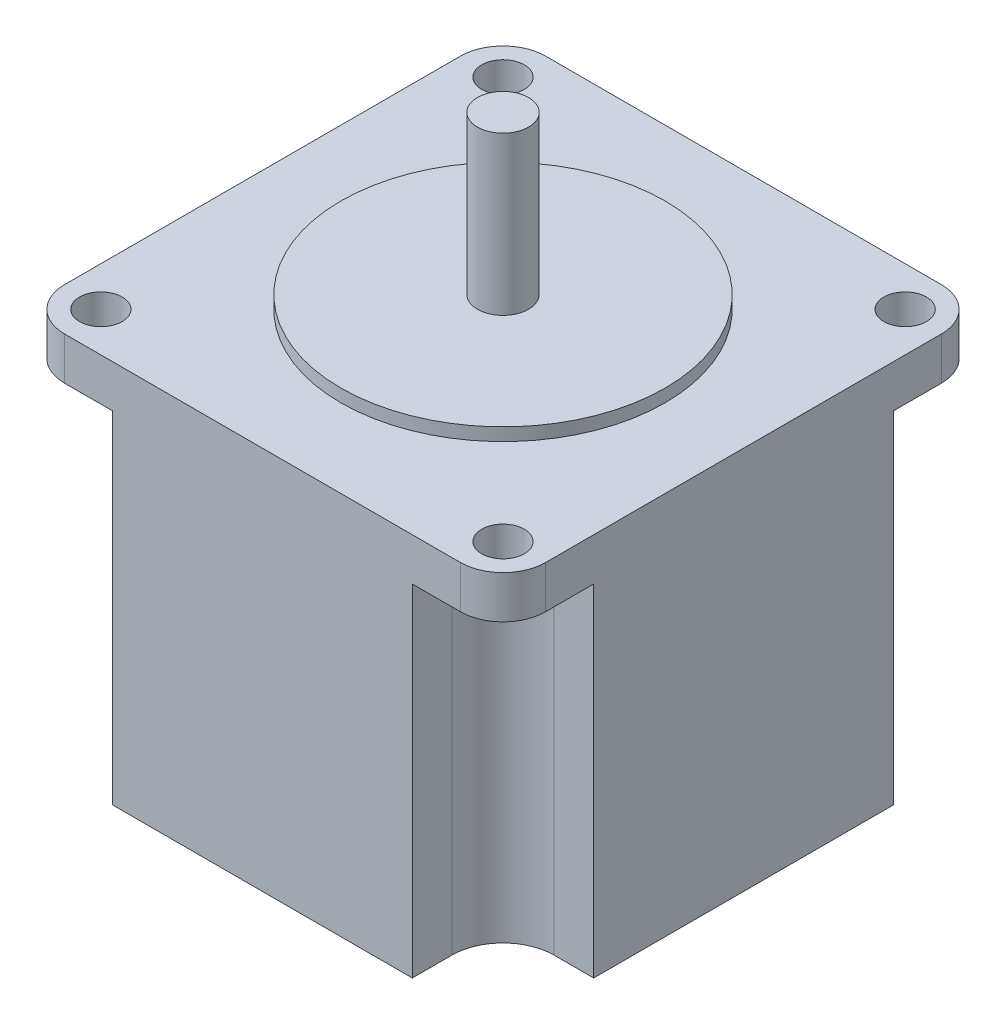
ISO-10303-21;
HEADER;
FILE_DESCRIPTION(('STEP AP214'),'2;1');
FILE_NAME('part.step','',(''),(''),'','','');
FILE_SCHEMA(('AUTOMOTIVE_DESIGN { 1 0 10303 214 1 1 1 1 }'));
ENDSEC;
DATA;
#1=APPLICATION_CONTEXT('core data for automotive mechanical design processes');
#2=APPLICATION_PROTOCOL_DEFINITION('international standard','automotive_design',2000,#1);
#3=PRODUCT_CONTEXT('',#1,'mechanical');
#4=PRODUCT('Part','Part','',(#3));
#5=PRODUCT_RELATED_PRODUCT_CATEGORY('part','',(#4));
#6=PRODUCT_DEFINITION_FORMATION('','',#4);
#7=PRODUCT_DEFINITION_CONTEXT('part definition',#1,'design');
#8=PRODUCT_DEFINITION('design','',#6,#7);
#9=PRODUCT_DEFINITION_SHAPE('','',#8);
#10=(LENGTH_UNIT() NAMED_UNIT(*) SI_UNIT(.MILLI.,.METRE.));
#11=(NAMED_UNIT(*) PLANE_ANGLE_UNIT() SI_UNIT($,.RADIAN.));
#12=(NAMED_UNIT(*) SI_UNIT($,.STERADIAN.) SOLID_ANGLE_UNIT());
#13=UNCERTAINTY_MEASURE_WITH_UNIT(LENGTH_MEASURE(1.E-05),#10,'distance_accuracy_value','');
#14=(GEOMETRIC_REPRESENTATION_CONTEXT(3) GLOBAL_UNCERTAINTY_ASSIGNED_CONTEXT((#13)) GLOBAL_UNIT_ASSIGNED_CONTEXT((#10,
#11,#12)) REPRESENTATION_CONTEXT('',''));
#15=CARTESIAN_POINT('',(0.,0.,0.));
#16=DIRECTION('',(0.,0.,1.));
#17=DIRECTION('',(1.,0.,0.));
#18=AXIS2_PLACEMENT_3D('',#15,#16,#17);
#19=CARTESIAN_POINT('',(-23.2,0.,23.2));
#20=DIRECTION('',(0.,1.,0.));
#21=DIRECTION('',(0.,0.,1.));
#22=AXIS2_PLACEMENT_3D('',#19,#20,#21);
#23=PLANE('',#22);
#24=DIRECTION('',(-1.,0.,0.));
#25=VECTOR('',#24,1.);
#26=CARTESIAN_POINT('',(-28.2,0.,17.57));
#27=LINE('',#26,#25);
#28=CARTESIAN_POINT('',(-23.57,0.,17.57));
#29=VERTEX_POINT('',#28);
#30=CARTESIAN_POINT('',(-28.2,0.,17.57));
#31=VERTEX_POINT('',#30);
#32=EDGE_CURVE('E324',#29,#31,#27,.T.);
#33=ORIENTED_EDGE('',*,*,#32,.T.);
#34=DIRECTION('',(0.,0.,1.));
#35=VECTOR('',#34,1.);
#36=CARTESIAN_POINT('',(-28.2,0.,23.2));
#37=LINE('',#36,#35);
#38=CARTESIAN_POINT('',(-28.2,0.,-17.57));
#39=VERTEX_POINT('',#38);
#40=EDGE_CURVE('E413',#39,#31,#37,.T.);
#41=ORIENTED_EDGE('',*,*,#40,.F.);
#42=DIRECTION('',(1.,0.,0.));
#43=VECTOR('',#42,1.);
#44=CARTESIAN_POINT('',(-28.2,0.,-17.57));
#45=LINE('',#44,#43);
#46=CARTESIAN_POINT('',(-23.57,0.,-17.57));
#47=VERTEX_POINT('',#46);
#48=EDGE_CURVE('E260',#39,#47,#45,.T.);
#49=ORIENTED_EDGE('',*,*,#48,.T.);
#50=CARTESIAN_POINT('',(-23.57,0.,-23.57));
#51=DIRECTION('',(0.,1.,0.));
#52=DIRECTION('',(0.,0.,1.));
#53=AXIS2_PLACEMENT_3D('',#50,#51,#52);
#54=CIRCLE('',#53,6.);
#55=CARTESIAN_POINT('',(-17.57,0.,-23.57));
#56=VERTEX_POINT('',#55);
#57=EDGE_CURVE('E266',#47,#56,#54,.T.);
#58=ORIENTED_EDGE('',*,*,#57,.T.);
#59=DIRECTION('',(0.,0.,-1.));
#60=VECTOR('',#59,1.);
#61=CARTESIAN_POINT('',(-17.57,0.,-23.57));
#62=LINE('',#61,#60);
#63=CARTESIAN_POINT('',(-17.57,0.,-28.2));
#64=VERTEX_POINT('',#63);
#65=EDGE_CURVE('E373',#56,#64,#62,.T.);
#66=ORIENTED_EDGE('',*,*,#65,.T.);
#67=DIRECTION('',(-1.,0.,0.));
#68=VECTOR('',#67,1.);
#69=CARTESIAN_POINT('',(-23.2,0.,-28.2));
#70=LINE('',#69,#68);
#71=CARTESIAN_POINT('',(17.57,0.,-28.2));
#72=VERTEX_POINT('',#71);
#73=EDGE_CURVE('E441',#72,#64,#70,.T.);
#74=ORIENTED_EDGE('',*,*,#73,.F.);
#75=DIRECTION('',(0.,0.,1.));
#76=VECTOR('',#75,1.);
#77=CARTESIAN_POINT('',(17.57,0.,-23.57));
#78=LINE('',#77,#76);
#79=CARTESIAN_POINT('',(17.57,0.,-23.57));
#80=VERTEX_POINT('',#79);
#81=EDGE_CURVE('E366',#72,#80,#78,.T.);
#82=ORIENTED_EDGE('',*,*,#81,.T.);
#83=CARTESIAN_POINT('',(23.57,0.,-23.57));
#84=DIRECTION('',(0.,1.,0.));
#85=DIRECTION('',(0.,0.,-1.));
#86=AXIS2_PLACEMENT_3D('',#83,#84,#85);
#87=CIRCLE('',#86,5.99999999999998);
#88=CARTESIAN_POINT('',(23.57,0.,-17.57));
#89=VERTEX_POINT('',#88);
#90=EDGE_CURVE('E361',#80,#89,#87,.T.);
#91=ORIENTED_EDGE('',*,*,#90,.T.);
#92=DIRECTION('',(1.,0.,0.));
#93=VECTOR('',#92,1.);
#94=CARTESIAN_POINT('',(28.2,0.,-17.57));
#95=LINE('',#94,#93);
#96=CARTESIAN_POINT('',(28.2,0.,-17.57));
#97=VERTEX_POINT('',#96);
#98=EDGE_CURVE('E356',#89,#97,#95,.T.);
#99=ORIENTED_EDGE('',*,*,#98,.T.);
#100=DIRECTION('',(0.,0.,-1.));
#101=VECTOR('',#100,1.);
#102=CARTESIAN_POINT('',(28.2,0.,23.2));
#103=LINE('',#102,#101);
#104=CARTESIAN_POINT('',(28.2,0.,17.57));
#105=VERTEX_POINT('',#104);
#106=EDGE_CURVE('E438',#105,#97,#103,.T.);
#107=ORIENTED_EDGE('',*,*,#106,.F.);
#108=DIRECTION('',(-1.,0.,0.));
#109=VECTOR('',#108,1.);
#110=CARTESIAN_POINT('',(28.2,0.,17.57));
#111=LINE('',#110,#109);
#112=CARTESIAN_POINT('',(23.57,0.,17.57));
#113=VERTEX_POINT('',#112);
#114=EDGE_CURVE('E350',#105,#113,#111,.T.);
#115=ORIENTED_EDGE('',*,*,#114,.T.);
#116=CARTESIAN_POINT('',(23.57,0.,23.57));
#117=DIRECTION('',(0.,1.,0.));
#118=DIRECTION('',(0.,0.,1.));
#119=AXIS2_PLACEMENT_3D('',#116,#117,#118);
#120=CIRCLE('',#119,6.);
#121=CARTESIAN_POINT('',(17.57,0.,23.57));
#122=VERTEX_POINT('',#121);
#123=EDGE_CURVE('E79',#113,#122,#120,.T.);
#124=ORIENTED_EDGE('',*,*,#123,.T.);
#125=DIRECTION('',(0.,0.,1.));
#126=VECTOR('',#125,1.);
#127=CARTESIAN_POINT('',(17.57,0.,23.57));
#128=LINE('',#127,#126);
#129=CARTESIAN_POINT('',(17.57,0.,28.2));
#130=VERTEX_POINT('',#129);
#131=EDGE_CURVE('E342',#122,#130,#128,.T.);
#132=ORIENTED_EDGE('',*,*,#131,.T.);
#133=DIRECTION('',(1.,0.,0.));
#134=VECTOR('',#133,1.);
#135=CARTESIAN_POINT('',(-23.2,0.,28.2));
#136=LINE('',#135,#134);
#137=CARTESIAN_POINT('',(-17.57,0.,28.2));
#138=VERTEX_POINT('',#137);
#139=EDGE_CURVE('E434',#138,#130,#136,.T.);
#140=ORIENTED_EDGE('',*,*,#139,.F.);
#141=DIRECTION('',(0.,0.,-1.));
#142=VECTOR('',#141,1.);
#143=CARTESIAN_POINT('',(-17.57,0.,23.57));
#144=LINE('',#143,#142);
#145=CARTESIAN_POINT('',(-17.57,0.,23.57));
#146=VERTEX_POINT('',#145);
#147=EDGE_CURVE('E335',#138,#146,#144,.T.);
#148=ORIENTED_EDGE('',*,*,#147,.T.);
#149=CARTESIAN_POINT('',(-23.57,0.,23.57));
#150=DIRECTION('',(0.,1.,0.));
#151=DIRECTION('',(0.,0.,-1.));
#152=AXIS2_PLACEMENT_3D('',#149,#150,#151);
#153=CIRCLE('',#152,6.);
#154=EDGE_CURVE('E68',#146,#29,#153,.T.);
#155=ORIENTED_EDGE('',*,*,#154,.T.);
#156=EDGE_LOOP('',(#33,#41,#49,#58,#66,#74,#82,#91,#99,#107,#115,#124,#132,#140,#148,#155));
#157=FACE_BOUND('',#156,.T.);
#158=ADVANCED_FACE('F48',(#157),#23,.F.);
#159=CARTESIAN_POINT('',(-23.2,45.,23.2));
#160=DIRECTION('',(0.,-1.,0.));
#161=DIRECTION('',(0.,0.,-1.));
#162=AXIS2_PLACEMENT_3D('',#159,#160,#161);
#163=CYLINDRICAL_SURFACE('',#162,5.);
#164=DIRECTION('',(0.,-1.,0.));
#165=VECTOR('',#164,1.);
#166=CARTESIAN_POINT('',(-28.2,45.,23.2));
#167=LINE('',#166,#165);
#168=CARTESIAN_POINT('',(-28.2,45.,23.2));
#169=VERTEX_POINT('',#168);
#170=CARTESIAN_POINT('',(-28.2,40.,23.2));
#171=VERTEX_POINT('',#170);
#172=EDGE_CURVE('E433',#169,#171,#167,.T.);
#173=ORIENTED_EDGE('',*,*,#172,.T.);
#174=CARTESIAN_POINT('',(-23.2,40.,23.2));
#175=DIRECTION('',(0.,1.,0.));
#176=DIRECTION('',(0.,0.,1.));
#177=AXIS2_PLACEMENT_3D('',#174,#175,#176);
#178=CIRCLE('',#177,5.);
#179=CARTESIAN_POINT('',(-23.2,40.,28.2));
#180=VERTEX_POINT('',#179);
#181=EDGE_CURVE('E377',#171,#180,#178,.T.);
#182=ORIENTED_EDGE('',*,*,#181,.T.);
#183=DIRECTION('',(0.,-1.,0.));
#184=VECTOR('',#183,1.);
#185=CARTESIAN_POINT('',(-23.2,45.,28.2));
#186=LINE('',#185,#184);
#187=CARTESIAN_POINT('',(-23.2,45.,28.2));
#188=VERTEX_POINT('',#187);
#189=EDGE_CURVE('E288',#188,#180,#186,.T.);
#190=ORIENTED_EDGE('',*,*,#189,.F.);
#191=CARTESIAN_POINT('',(-23.2,45.,23.2));
#192=DIRECTION('',(0.,1.,0.));
#193=DIRECTION('',(0.,0.,1.));
#194=AXIS2_PLACEMENT_3D('',#191,#192,#193);
#195=CIRCLE('',#194,5.);
#196=EDGE_CURVE('E408',#169,#188,#195,.T.);
#197=ORIENTED_EDGE('',*,*,#196,.F.);
#198=EDGE_LOOP('',(#173,#182,#190,#197));
#199=FACE_BOUND('',#198,.T.);
#200=ADVANCED_FACE('F50',(#199),#163,.T.);
#201=CARTESIAN_POINT('',(-23.2,45.,28.2));
#202=DIRECTION('',(0.,0.,-1.));
#203=DIRECTION('',(-1.,0.,0.));
#204=AXIS2_PLACEMENT_3D('',#201,#202,#203);
#205=PLANE('',#204);
#206=ORIENTED_EDGE('',*,*,#189,.T.);
#207=DIRECTION('',(1.,0.,0.));
#208=VECTOR('',#207,1.);
#209=CARTESIAN_POINT('',(-23.2,40.,28.2));
#210=LINE('',#209,#208);
#211=CARTESIAN_POINT('',(-17.57,40.,28.2));
#212=VERTEX_POINT('',#211);
#213=EDGE_CURVE('E381',#180,#212,#210,.T.);
#214=ORIENTED_EDGE('',*,*,#213,.T.);
#215=DIRECTION('',(0.,-1.,0.));
#216=VECTOR('',#215,1.);
#217=CARTESIAN_POINT('',(-17.57,127.803145097442,28.2));
#218=LINE('',#217,#216);
#219=EDGE_CURVE('E331',#212,#138,#218,.T.);
#220=ORIENTED_EDGE('',*,*,#219,.T.);
#221=ORIENTED_EDGE('',*,*,#139,.T.);
#222=DIRECTION('',(0.,-1.,0.));
#223=VECTOR('',#222,1.);
#224=CARTESIAN_POINT('',(17.57,127.803145097442,28.2));
#225=LINE('',#224,#223);
#226=CARTESIAN_POINT('',(17.57,40.,28.2));
#227=VERTEX_POINT('',#226);
#228=EDGE_CURVE('E336',#227,#130,#225,.T.);
#229=ORIENTED_EDGE('',*,*,#228,.F.);
#230=CARTESIAN_POINT('',(23.2,40.,28.2));
#231=VERTEX_POINT('',#230);
#232=EDGE_CURVE('E387',#227,#231,#210,.T.);
#233=ORIENTED_EDGE('',*,*,#232,.T.);
#234=DIRECTION('',(0.,-1.,0.));
#235=VECTOR('',#234,1.);
#236=CARTESIAN_POINT('',(23.2,45.,28.2));
#237=LINE('',#236,#235);
#238=CARTESIAN_POINT('',(23.2,45.,28.2));
#239=VERTEX_POINT('',#238);
#240=EDGE_CURVE('E466',#239,#231,#237,.T.);
#241=ORIENTED_EDGE('',*,*,#240,.F.);
#242=DIRECTION('',(1.,0.,0.));
#243=VECTOR('',#242,1.);
#244=CARTESIAN_POINT('',(-23.2,45.,28.2));
#245=LINE('',#244,#243);
#246=EDGE_CURVE('E412',#188,#239,#245,.T.);
#247=ORIENTED_EDGE('',*,*,#246,.F.);
#248=EDGE_LOOP('',(#206,#214,#220,#221,#229,#233,#241,#247));
#249=FACE_BOUND('',#248,.T.);
#250=ADVANCED_FACE('F479',(#249),#205,.F.);
#251=CARTESIAN_POINT('',(23.2,45.,23.2));
#252=DIRECTION('',(0.,-1.,0.));
#253=DIRECTION('',(0.,0.,-1.));
#254=AXIS2_PLACEMENT_3D('',#251,#252,#253);
#255=CYLINDRICAL_SURFACE('',#254,5.);
#256=ORIENTED_EDGE('',*,*,#240,.T.);
#257=CARTESIAN_POINT('',(23.2,40.,23.2));
#258=DIRECTION('',(0.,1.,0.));
#259=DIRECTION('',(0.,0.,1.));
#260=AXIS2_PLACEMENT_3D('',#257,#258,#259);
#261=CIRCLE('',#260,5.);
#262=CARTESIAN_POINT('',(28.2,40.,23.2));
#263=VERTEX_POINT('',#262);
#264=EDGE_CURVE('E404',#231,#263,#261,.T.);
#265=ORIENTED_EDGE('',*,*,#264,.T.);
#266=DIRECTION('',(0.,-1.,0.));
#267=VECTOR('',#266,1.);
#268=CARTESIAN_POINT('',(28.2,45.,23.2));
#269=LINE('',#268,#267);
#270=CARTESIAN_POINT('',(28.2,45.,23.2));
#271=VERTEX_POINT('',#270);
#272=EDGE_CURVE('E463',#271,#263,#269,.T.);
#273=ORIENTED_EDGE('',*,*,#272,.F.);
#274=CARTESIAN_POINT('',(23.2,45.,23.2));
#275=DIRECTION('',(0.,1.,0.));
#276=DIRECTION('',(0.,0.,-1.));
#277=AXIS2_PLACEMENT_3D('',#274,#275,#276);
#278=CIRCLE('',#277,5.);
#279=EDGE_CURVE('E416',#239,#271,#278,.T.);
#280=ORIENTED_EDGE('',*,*,#279,.F.);
#281=EDGE_LOOP('',(#256,#265,#273,#280));
#282=FACE_BOUND('',#281,.T.);
#283=ADVANCED_FACE('F627',(#282),#255,.T.);
#284=CARTESIAN_POINT('',(28.2,45.,23.2));
#285=DIRECTION('',(-1.,0.,0.));
#286=DIRECTION('',(0.,0.,1.));
#287=AXIS2_PLACEMENT_3D('',#284,#285,#286);
#288=PLANE('',#287);
#289=ORIENTED_EDGE('',*,*,#272,.T.);
#290=DIRECTION('',(0.,0.,-1.));
#291=VECTOR('',#290,1.);
#292=CARTESIAN_POINT('',(28.2,40.,23.2));
#293=LINE('',#292,#291);
#294=CARTESIAN_POINT('',(28.2,40.,17.57));
#295=VERTEX_POINT('',#294);
#296=EDGE_CURVE('E403',#263,#295,#293,.T.);
#297=ORIENTED_EDGE('',*,*,#296,.T.);
#298=DIRECTION('',(0.,-1.,0.));
#299=VECTOR('',#298,1.);
#300=CARTESIAN_POINT('',(28.2,127.803145097442,17.57));
#301=LINE('',#300,#299);
#302=EDGE_CURVE('E346',#295,#105,#301,.T.);
#303=ORIENTED_EDGE('',*,*,#302,.T.);
#304=ORIENTED_EDGE('',*,*,#106,.T.);
#305=DIRECTION('',(0.,-1.,0.));
#306=VECTOR('',#305,1.);
#307=CARTESIAN_POINT('',(28.2,127.803145097442,-17.57));
#308=LINE('',#307,#306);
#309=CARTESIAN_POINT('',(28.2,40.,-17.57));
#310=VERTEX_POINT('',#309);
#311=EDGE_CURVE('E351',#310,#97,#308,.T.);
#312=ORIENTED_EDGE('',*,*,#311,.F.);
#313=CARTESIAN_POINT('',(28.2,40.,-23.2));
#314=VERTEX_POINT('',#313);
#315=EDGE_CURVE('E399',#310,#314,#293,.T.);
#316=ORIENTED_EDGE('',*,*,#315,.T.);
#317=DIRECTION('',(0.,-1.,0.));
#318=VECTOR('',#317,1.);
#319=CARTESIAN_POINT('',(28.2,45.,-23.2));
#320=LINE('',#319,#318);
#321=CARTESIAN_POINT('',(28.2,45.,-23.2));
#322=VERTEX_POINT('',#321);
#323=EDGE_CURVE('E459',#322,#314,#320,.T.);
#324=ORIENTED_EDGE('',*,*,#323,.F.);
#325=DIRECTION('',(0.,0.,-1.));
#326=VECTOR('',#325,1.);
#327=CARTESIAN_POINT('',(28.2,45.,23.2));
#328=LINE('',#327,#326);
#329=EDGE_CURVE('E419',#271,#322,#328,.T.);
#330=ORIENTED_EDGE('',*,*,#329,.F.);
#331=EDGE_LOOP('',(#289,#297,#303,#304,#312,#316,#324,#330));
#332=FACE_BOUND('',#331,.T.);
#333=ADVANCED_FACE('F575',(#332),#288,.F.);
#334=CARTESIAN_POINT('',(23.2,45.,-23.2));
#335=DIRECTION('',(0.,-1.,0.));
#336=DIRECTION('',(0.,0.,-1.));
#337=AXIS2_PLACEMENT_3D('',#334,#335,#336);
#338=CYLINDRICAL_SURFACE('',#337,5.);
#339=ORIENTED_EDGE('',*,*,#323,.T.);
#340=CARTESIAN_POINT('',(23.2,40.,-23.2));
#341=DIRECTION('',(0.,1.,0.));
#342=DIRECTION('',(0.,0.,1.));
#343=AXIS2_PLACEMENT_3D('',#340,#341,#342);
#344=CIRCLE('',#343,5.);
#345=CARTESIAN_POINT('',(23.2,40.,-28.2));
#346=VERTEX_POINT('',#345);
#347=EDGE_CURVE('E395',#314,#346,#344,.T.);
#348=ORIENTED_EDGE('',*,*,#347,.T.);
#349=DIRECTION('',(0.,-1.,0.));
#350=VECTOR('',#349,1.);
#351=CARTESIAN_POINT('',(23.2,45.,-28.2));
#352=LINE('',#351,#350);
#353=CARTESIAN_POINT('',(23.2,45.,-28.2));
#354=VERTEX_POINT('',#353);
#355=EDGE_CURVE('E455',#354,#346,#352,.T.);
#356=ORIENTED_EDGE('',*,*,#355,.F.);
#357=CARTESIAN_POINT('',(23.2,45.,-23.2));
#358=DIRECTION('',(0.,1.,0.));
#359=DIRECTION('',(0.,0.,-1.));
#360=AXIS2_PLACEMENT_3D('',#357,#358,#359);
#361=CIRCLE('',#360,5.);
#362=EDGE_CURVE('E422',#322,#354,#361,.T.);
#363=ORIENTED_EDGE('',*,*,#362,.F.);
#364=EDGE_LOOP('',(#339,#348,#356,#363));
#365=FACE_BOUND('',#364,.T.);
#366=ADVANCED_FACE('F621',(#365),#338,.T.);
#367=CARTESIAN_POINT('',(-23.2,45.,-28.2));
#368=DIRECTION('',(0.,0.,1.));
#369=DIRECTION('',(1.,0.,0.));
#370=AXIS2_PLACEMENT_3D('',#367,#368,#369);
#371=PLANE('',#370);
#372=ORIENTED_EDGE('',*,*,#355,.T.);
#373=DIRECTION('',(-1.,0.,0.));
#374=VECTOR('',#373,1.);
#375=CARTESIAN_POINT('',(-23.2,40.,-28.2));
#376=LINE('',#375,#374);
#377=CARTESIAN_POINT('',(17.57,40.,-28.2));
#378=VERTEX_POINT('',#377);
#379=EDGE_CURVE('E394',#346,#378,#376,.T.);
#380=ORIENTED_EDGE('',*,*,#379,.T.);
#381=DIRECTION('',(0.,-1.,0.));
#382=VECTOR('',#381,1.);
#383=CARTESIAN_POINT('',(17.57,127.803145097442,-28.2));
#384=LINE('',#383,#382);
#385=EDGE_CURVE('E362',#378,#72,#384,.T.);
#386=ORIENTED_EDGE('',*,*,#385,.T.);
#387=ORIENTED_EDGE('',*,*,#73,.T.);
#388=DIRECTION('',(0.,-1.,0.));
#389=VECTOR('',#388,1.);
#390=CARTESIAN_POINT('',(-17.57,127.803145097442,-28.2));
#391=LINE('',#390,#389);
#392=CARTESIAN_POINT('',(-17.57,40.,-28.2));
#393=VERTEX_POINT('',#392);
#394=EDGE_CURVE('E367',#393,#64,#391,.T.);
#395=ORIENTED_EDGE('',*,*,#394,.F.);
#396=CARTESIAN_POINT('',(-23.2,40.,-28.2));
#397=VERTEX_POINT('',#396);
#398=EDGE_CURVE('E390',#393,#397,#376,.T.);
#399=ORIENTED_EDGE('',*,*,#398,.T.);
#400=DIRECTION('',(0.,-1.,0.));
#401=VECTOR('',#400,1.);
#402=CARTESIAN_POINT('',(-23.2,45.,-28.2));
#403=LINE('',#402,#401);
#404=CARTESIAN_POINT('',(-23.2,45.,-28.2));
#405=VERTEX_POINT('',#404);
#406=EDGE_CURVE('E451',#405,#397,#403,.T.);
#407=ORIENTED_EDGE('',*,*,#406,.F.);
#408=DIRECTION('',(-1.,0.,0.));
#409=VECTOR('',#408,1.);
#410=CARTESIAN_POINT('',(-23.2,45.,-28.2));
#411=LINE('',#410,#409);
#412=EDGE_CURVE('E425',#354,#405,#411,.T.);
#413=ORIENTED_EDGE('',*,*,#412,.F.);
#414=EDGE_LOOP('',(#372,#380,#386,#387,#395,#399,#407,#413));
#415=FACE_BOUND('',#414,.T.);
#416=ADVANCED_FACE('F560',(#415),#371,.F.);
#417=CARTESIAN_POINT('',(-23.2,45.,-23.2));
#418=DIRECTION('',(0.,-1.,0.));
#419=DIRECTION('',(0.,0.,-1.));
#420=AXIS2_PLACEMENT_3D('',#417,#418,#419);
#421=CYLINDRICAL_SURFACE('',#420,5.);
#422=ORIENTED_EDGE('',*,*,#406,.T.);
#423=CARTESIAN_POINT('',(-23.2,40.,-23.2));
#424=DIRECTION('',(0.,1.,0.));
#425=DIRECTION('',(0.,0.,1.));
#426=AXIS2_PLACEMENT_3D('',#423,#424,#425);
#427=CIRCLE('',#426,5.);
#428=CARTESIAN_POINT('',(-28.2,40.,-23.2));
#429=VERTEX_POINT('',#428);
#430=EDGE_CURVE('E386',#397,#429,#427,.T.);
#431=ORIENTED_EDGE('',*,*,#430,.T.);
#432=DIRECTION('',(0.,-1.,0.));
#433=VECTOR('',#432,1.);
#434=CARTESIAN_POINT('',(-28.2,45.,-23.2));
#435=LINE('',#434,#433);
#436=CARTESIAN_POINT('',(-28.2,45.,-23.2));
#437=VERTEX_POINT('',#436);
#438=EDGE_CURVE('E281',#437,#429,#435,.T.);
#439=ORIENTED_EDGE('',*,*,#438,.F.);
#440=CARTESIAN_POINT('',(-23.2,45.,-23.2));
#441=DIRECTION('',(0.,1.,0.));
#442=DIRECTION('',(0.,0.,-1.));
#443=AXIS2_PLACEMENT_3D('',#440,#441,#442);
#444=CIRCLE('',#443,5.);
#445=EDGE_CURVE('E428',#405,#437,#444,.T.);
#446=ORIENTED_EDGE('',*,*,#445,.F.);
#447=EDGE_LOOP('',(#422,#431,#439,#446));
#448=FACE_BOUND('',#447,.T.);
#449=ADVANCED_FACE('F615',(#448),#421,.T.);
#450=CARTESIAN_POINT('',(-28.2,45.,23.2));
#451=DIRECTION('',(1.,0.,0.));
#452=DIRECTION('',(0.,0.,-1.));
#453=AXIS2_PLACEMENT_3D('',#450,#451,#452);
#454=PLANE('',#453);
#455=ORIENTED_EDGE('',*,*,#438,.T.);
#456=DIRECTION('',(0.,0.,1.));
#457=VECTOR('',#456,1.);
#458=CARTESIAN_POINT('',(-28.2,40.,23.2));
#459=LINE('',#458,#457);
#460=CARTESIAN_POINT('',(-28.2,40.,-17.57));
#461=VERTEX_POINT('',#460);
#462=EDGE_CURVE('E58',#429,#461,#459,.T.);
#463=ORIENTED_EDGE('',*,*,#462,.T.);
#464=DIRECTION('',(0.,-1.,0.));
#465=VECTOR('',#464,1.);
#466=CARTESIAN_POINT('',(-28.2,127.803145097442,-17.57));
#467=LINE('',#466,#465);
#468=EDGE_CURVE('E254',#461,#39,#467,.T.);
#469=ORIENTED_EDGE('',*,*,#468,.T.);
#470=ORIENTED_EDGE('',*,*,#40,.T.);
#471=DIRECTION('',(0.,-1.,0.));
#472=VECTOR('',#471,1.);
#473=CARTESIAN_POINT('',(-28.2,127.803145097442,17.57));
#474=LINE('',#473,#472);
#475=CARTESIAN_POINT('',(-28.2,40.,17.57));
#476=VERTEX_POINT('',#475);
#477=EDGE_CURVE('E309',#476,#31,#474,.T.);
#478=ORIENTED_EDGE('',*,*,#477,.F.);
#479=EDGE_CURVE('E283',#476,#171,#459,.T.);
#480=ORIENTED_EDGE('',*,*,#479,.T.);
#481=ORIENTED_EDGE('',*,*,#172,.F.);
#482=DIRECTION('',(0.,0.,1.));
#483=VECTOR('',#482,1.);
#484=CARTESIAN_POINT('',(-28.2,45.,23.2));
#485=LINE('',#484,#483);
#486=EDGE_CURVE('E431',#437,#169,#485,.T.);
#487=ORIENTED_EDGE('',*,*,#486,.F.);
#488=EDGE_LOOP('',(#455,#463,#469,#470,#478,#480,#481,#487));
#489=FACE_BOUND('',#488,.T.);
#490=ADVANCED_FACE('F278',(#489),#454,.F.);
#491=CARTESIAN_POINT('',(-23.2,45.,23.2));
#492=DIRECTION('',(0.,1.,0.));
#493=DIRECTION('',(0.,0.,1.));
#494=AXIS2_PLACEMENT_3D('',#491,#492,#493);
#495=PLANE('',#494);
#496=CARTESIAN_POINT('',(0.,45.,0.));
#497=DIRECTION('',(0.,1.,0.));
#498=DIRECTION('',(0.,0.,1.));
#499=AXIS2_PLACEMENT_3D('',#496,#497,#498);
#500=CIRCLE('',#499,19.);
#501=CARTESIAN_POINT('',(0.,45.,19.));
#502=VERTEX_POINT('',#501);
#503=EDGE_CURVE('E922',#502,#502,#500,.T.);
#504=ORIENTED_EDGE('',*,*,#503,.F.);
#505=EDGE_LOOP('',(#504));
#506=FACE_BOUND('',#505,.T.);
#507=CARTESIAN_POINT('',(-23.57,45.,23.57));
#508=DIRECTION('',(0.,1.,0.));
#509=DIRECTION('',(0.,0.,1.));
#510=AXIS2_PLACEMENT_3D('',#507,#508,#509);
#511=CIRCLE('',#510,2.5);
#512=CARTESIAN_POINT('',(-23.57,45.,26.07));
#513=VERTEX_POINT('',#512);
#514=EDGE_CURVE('E937',#513,#513,#511,.T.);
#515=ORIENTED_EDGE('',*,*,#514,.F.);
#516=EDGE_LOOP('',(#515));
#517=FACE_BOUND('',#516,.T.);
#518=CARTESIAN_POINT('',(23.57,45.,-23.57));
#519=DIRECTION('',(0.,1.,0.));
#520=DIRECTION('',(0.,0.,1.));
#521=AXIS2_PLACEMENT_3D('',#518,#519,#520);
#522=CIRCLE('',#521,2.5);
#523=CARTESIAN_POINT('',(23.57,45.,-21.07));
#524=VERTEX_POINT('',#523);
#525=EDGE_CURVE('E936',#524,#524,#522,.T.);
#526=ORIENTED_EDGE('',*,*,#525,.F.);
#527=EDGE_LOOP('',(#526));
#528=FACE_BOUND('',#527,.T.);
#529=CARTESIAN_POINT('',(-23.57,45.,-23.57));
#530=DIRECTION('',(0.,1.,0.));
#531=DIRECTION('',(0.,0.,1.));
#532=AXIS2_PLACEMENT_3D('',#529,#530,#531);
#533=CIRCLE('',#532,2.5);
#534=CARTESIAN_POINT('',(-23.57,45.,-21.07));
#535=VERTEX_POINT('',#534);
#536=EDGE_CURVE('E931',#535,#535,#533,.T.);
#537=ORIENTED_EDGE('',*,*,#536,.F.);
#538=EDGE_LOOP('',(#537));
#539=FACE_BOUND('',#538,.T.);
#540=CARTESIAN_POINT('',(23.57,45.,23.57));
#541=DIRECTION('',(0.,1.,0.));
#542=DIRECTION('',(0.,0.,1.));
#543=AXIS2_PLACEMENT_3D('',#540,#541,#542);
#544=CIRCLE('',#543,2.5);
#545=CARTESIAN_POINT('',(23.57,45.,26.07));
#546=VERTEX_POINT('',#545);
#547=EDGE_CURVE('E297',#546,#546,#544,.T.);
#548=ORIENTED_EDGE('',*,*,#547,.F.);
#549=EDGE_LOOP('',(#548));
#550=FACE_BOUND('',#549,.T.);
#551=ORIENTED_EDGE('',*,*,#196,.T.);
#552=ORIENTED_EDGE('',*,*,#246,.T.);
#553=ORIENTED_EDGE('',*,*,#279,.T.);
#554=ORIENTED_EDGE('',*,*,#329,.T.);
#555=ORIENTED_EDGE('',*,*,#362,.T.);
#556=ORIENTED_EDGE('',*,*,#412,.T.);
#557=ORIENTED_EDGE('',*,*,#445,.T.);
#558=ORIENTED_EDGE('',*,*,#486,.T.);
#559=EDGE_LOOP('',(#551,#552,#553,#554,#555,#556,#557,#558));
#560=FACE_BOUND('',#559,.T.);
#561=ADVANCED_FACE('F612',(#506,#517,#528,#539,#550,#560),#495,.T.);
#562=CARTESIAN_POINT('',(-28.2,127.803145097442,-17.57));
#563=DIRECTION('',(0.,0.,-1.));
#564=DIRECTION('',(-1.,0.,0.));
#565=AXIS2_PLACEMENT_3D('',#562,#563,#564);
#566=PLANE('',#565);
#567=DIRECTION('',(1.,0.,0.));
#568=VECTOR('',#567,1.);
#569=CARTESIAN_POINT('',(-28.2,40.,-17.57));
#570=LINE('',#569,#568);
#571=CARTESIAN_POINT('',(-23.57,40.,-17.57));
#572=VERTEX_POINT('',#571);
#573=EDGE_CURVE('E258',#461,#572,#570,.T.);
#574=ORIENTED_EDGE('',*,*,#573,.T.);
#575=DIRECTION('',(0.,-1.,0.));
#576=VECTOR('',#575,1.);
#577=CARTESIAN_POINT('',(-23.57,127.803145097442,-17.57));
#578=LINE('',#577,#576);
#579=EDGE_CURVE('E374',#572,#47,#578,.T.);
#580=ORIENTED_EDGE('',*,*,#579,.T.);
#581=ORIENTED_EDGE('',*,*,#48,.F.);
#582=ORIENTED_EDGE('',*,*,#468,.F.);
#583=EDGE_LOOP('',(#574,#580,#581,#582));
#584=FACE_BOUND('',#583,.T.);
#585=ADVANCED_FACE('F256',(#584),#566,.T.);
#586=CARTESIAN_POINT('',(-23.57,127.803145097442,-23.57));
#587=DIRECTION('',(0.,-1.,0.));
#588=DIRECTION('',(0.,0.,-1.));
#589=AXIS2_PLACEMENT_3D('',#586,#587,#588);
#590=CYLINDRICAL_SURFACE('',#589,6.);
#591=CARTESIAN_POINT('',(-23.57,40.,-23.57));
#592=DIRECTION('',(0.,1.,0.));
#593=DIRECTION('',(0.,0.,1.));
#594=AXIS2_PLACEMENT_3D('',#591,#592,#593);
#595=CIRCLE('',#594,6.);
#596=CARTESIAN_POINT('',(-17.57,40.,-23.57));
#597=VERTEX_POINT('',#596);
#598=EDGE_CURVE('E273',#572,#597,#595,.T.);
#599=ORIENTED_EDGE('',*,*,#598,.T.);
#600=DIRECTION('',(0.,-1.,0.));
#601=VECTOR('',#600,1.);
#602=CARTESIAN_POINT('',(-17.57,127.803145097442,-23.57));
#603=LINE('',#602,#601);
#604=EDGE_CURVE('E370',#597,#56,#603,.T.);
#605=ORIENTED_EDGE('',*,*,#604,.T.);
#606=ORIENTED_EDGE('',*,*,#57,.F.);
#607=ORIENTED_EDGE('',*,*,#579,.F.);
#608=EDGE_LOOP('',(#599,#605,#606,#607));
#609=FACE_BOUND('',#608,.T.);
#610=ADVANCED_FACE('F553',(#609),#590,.F.);
#611=CARTESIAN_POINT('',(-17.57,127.803145097442,-23.57));
#612=DIRECTION('',(-1.,0.,0.));
#613=DIRECTION('',(0.,0.,1.));
#614=AXIS2_PLACEMENT_3D('',#611,#612,#613);
#615=PLANE('',#614);
#616=DIRECTION('',(0.,0.,-1.));
#617=VECTOR('',#616,1.);
#618=CARTESIAN_POINT('',(-17.57,40.,-23.57));
#619=LINE('',#618,#617);
#620=EDGE_CURVE('E549',#597,#393,#619,.T.);
#621=ORIENTED_EDGE('',*,*,#620,.T.);
#622=ORIENTED_EDGE('',*,*,#394,.T.);
#623=ORIENTED_EDGE('',*,*,#65,.F.);
#624=ORIENTED_EDGE('',*,*,#604,.F.);
#625=EDGE_LOOP('',(#621,#622,#623,#624));
#626=FACE_BOUND('',#625,.T.);
#627=ADVANCED_FACE('F676',(#626),#615,.T.);
#628=CARTESIAN_POINT('',(-23.2,40.,23.2));
#629=DIRECTION('',(0.,1.,0.));
#630=DIRECTION('',(0.,0.,1.));
#631=AXIS2_PLACEMENT_3D('',#628,#629,#630);
#632=PLANE('',#631);
#633=CARTESIAN_POINT('',(-23.57,40.,-23.57));
#634=DIRECTION('',(0.,1.,0.));
#635=DIRECTION('',(0.,0.,1.));
#636=AXIS2_PLACEMENT_3D('',#633,#634,#635);
#637=CIRCLE('',#636,2.5);
#638=CARTESIAN_POINT('',(-23.57,40.,-21.07));
#639=VERTEX_POINT('',#638);
#640=EDGE_CURVE('E52',#639,#639,#637,.F.);
#641=ORIENTED_EDGE('',*,*,#640,.F.);
#642=EDGE_LOOP('',(#641));
#643=FACE_BOUND('',#642,.T.);
#644=ORIENTED_EDGE('',*,*,#620,.F.);
#645=ORIENTED_EDGE('',*,*,#598,.F.);
#646=ORIENTED_EDGE('',*,*,#573,.F.);
#647=ORIENTED_EDGE('',*,*,#462,.F.);
#648=ORIENTED_EDGE('',*,*,#430,.F.);
#649=ORIENTED_EDGE('',*,*,#398,.F.);
#650=EDGE_LOOP('',(#644,#645,#646,#647,#648,#649));
#651=FACE_BOUND('',#650,.T.);
#652=ADVANCED_FACE('F270',(#643,#651),#632,.F.);
#653=CARTESIAN_POINT('',(17.57,127.803145097442,-23.57));
#654=DIRECTION('',(1.,0.,0.));
#655=DIRECTION('',(0.,0.,-1.));
#656=AXIS2_PLACEMENT_3D('',#653,#654,#655);
#657=PLANE('',#656);
#658=DIRECTION('',(0.,0.,1.));
#659=VECTOR('',#658,1.);
#660=CARTESIAN_POINT('',(17.57,40.,-23.57));
#661=LINE('',#660,#659);
#662=CARTESIAN_POINT('',(17.57,40.,-23.57));
#663=VERTEX_POINT('',#662);
#664=EDGE_CURVE('E545',#378,#663,#661,.T.);
#665=ORIENTED_EDGE('',*,*,#664,.T.);
#666=DIRECTION('',(0.,-1.,0.));
#667=VECTOR('',#666,1.);
#668=CARTESIAN_POINT('',(17.57,127.803145097442,-23.57));
#669=LINE('',#668,#667);
#670=EDGE_CURVE('E357',#663,#80,#669,.T.);
#671=ORIENTED_EDGE('',*,*,#670,.T.);
#672=ORIENTED_EDGE('',*,*,#81,.F.);
#673=ORIENTED_EDGE('',*,*,#385,.F.);
#674=EDGE_LOOP('',(#665,#671,#672,#673));
#675=FACE_BOUND('',#674,.T.);
#676=ADVANCED_FACE('F564',(#675),#657,.T.);
#677=CARTESIAN_POINT('',(23.57,127.803145097442,-23.57));
#678=DIRECTION('',(0.,-1.,0.));
#679=DIRECTION('',(0.,0.,-1.));
#680=AXIS2_PLACEMENT_3D('',#677,#678,#679);
#681=CYLINDRICAL_SURFACE('',#680,5.99999999999998);
#682=CARTESIAN_POINT('',(23.57,40.,-23.57));
#683=DIRECTION('',(0.,1.,0.));
#684=DIRECTION('',(0.,0.,1.));
#685=AXIS2_PLACEMENT_3D('',#682,#683,#684);
#686=CIRCLE('',#685,5.99999999999998);
#687=CARTESIAN_POINT('',(23.57,40.,-17.57));
#688=VERTEX_POINT('',#687);
#689=EDGE_CURVE('E542',#663,#688,#686,.T.);
#690=ORIENTED_EDGE('',*,*,#689,.T.);
#691=DIRECTION('',(0.,-1.,0.));
#692=VECTOR('',#691,1.);
#693=CARTESIAN_POINT('',(23.57,127.803145097442,-17.57));
#694=LINE('',#693,#692);
#695=EDGE_CURVE('E354',#688,#89,#694,.T.);
#696=ORIENTED_EDGE('',*,*,#695,.T.);
#697=ORIENTED_EDGE('',*,*,#90,.F.);
#698=ORIENTED_EDGE('',*,*,#670,.F.);
#699=EDGE_LOOP('',(#690,#696,#697,#698));
#700=FACE_BOUND('',#699,.T.);
#701=ADVANCED_FACE('F569',(#700),#681,.F.);
#702=CARTESIAN_POINT('',(28.2,127.803145097442,-17.57));
#703=DIRECTION('',(0.,0.,-1.));
#704=DIRECTION('',(-1.,0.,0.));
#705=AXIS2_PLACEMENT_3D('',#702,#703,#704);
#706=PLANE('',#705);
#707=DIRECTION('',(1.,0.,0.));
#708=VECTOR('',#707,1.);
#709=CARTESIAN_POINT('',(28.2,40.,-17.57));
#710=LINE('',#709,#708);
#711=EDGE_CURVE('E538',#688,#310,#710,.T.);
#712=ORIENTED_EDGE('',*,*,#711,.T.);
#713=ORIENTED_EDGE('',*,*,#311,.T.);
#714=ORIENTED_EDGE('',*,*,#98,.F.);
#715=ORIENTED_EDGE('',*,*,#695,.F.);
#716=EDGE_LOOP('',(#712,#713,#714,#715));
#717=FACE_BOUND('',#716,.T.);
#718=ADVANCED_FACE('F572',(#717),#706,.T.);
#719=CARTESIAN_POINT('',(23.57,40.,-23.57));
#720=DIRECTION('',(0.,1.,0.));
#721=DIRECTION('',(0.,0.,1.));
#722=AXIS2_PLACEMENT_3D('',#719,#720,#721);
#723=CIRCLE('',#722,2.5);
#724=CARTESIAN_POINT('',(23.57,40.,-21.07));
#725=VERTEX_POINT('',#724);
#726=EDGE_CURVE('E300',#725,#725,#723,.F.);
#727=ORIENTED_EDGE('',*,*,#726,.F.);
#728=EDGE_LOOP('',(#727));
#729=FACE_BOUND('',#728,.T.);
#730=ORIENTED_EDGE('',*,*,#711,.F.);
#731=ORIENTED_EDGE('',*,*,#689,.F.);
#732=ORIENTED_EDGE('',*,*,#664,.F.);
#733=ORIENTED_EDGE('',*,*,#379,.F.);
#734=ORIENTED_EDGE('',*,*,#347,.F.);
#735=ORIENTED_EDGE('',*,*,#315,.F.);
#736=EDGE_LOOP('',(#730,#731,#732,#733,#734,#735));
#737=FACE_BOUND('',#736,.T.);
#738=ADVANCED_FACE('F687',(#729,#737),#632,.F.);
#739=CARTESIAN_POINT('',(28.2,127.803145097442,17.57));
#740=DIRECTION('',(0.,0.,1.));
#741=DIRECTION('',(1.,0.,0.));
#742=AXIS2_PLACEMENT_3D('',#739,#740,#741);
#743=PLANE('',#742);
#744=DIRECTION('',(-1.,0.,0.));
#745=VECTOR('',#744,1.);
#746=CARTESIAN_POINT('',(28.2,40.,17.57));
#747=LINE('',#746,#745);
#748=CARTESIAN_POINT('',(23.57,40.,17.57));
#749=VERTEX_POINT('',#748);
#750=EDGE_CURVE('E534',#295,#749,#747,.T.);
#751=ORIENTED_EDGE('',*,*,#750,.T.);
#752=DIRECTION('',(0.,-1.,0.));
#753=VECTOR('',#752,1.);
#754=CARTESIAN_POINT('',(23.57,127.803145097442,17.57));
#755=LINE('',#754,#753);
#756=EDGE_CURVE('E343',#749,#113,#755,.T.);
#757=ORIENTED_EDGE('',*,*,#756,.T.);
#758=ORIENTED_EDGE('',*,*,#114,.F.);
#759=ORIENTED_EDGE('',*,*,#302,.F.);
#760=EDGE_LOOP('',(#751,#757,#758,#759));
#761=FACE_BOUND('',#760,.T.);
#762=ADVANCED_FACE('F580',(#761),#743,.T.);
#763=CARTESIAN_POINT('',(23.57,127.803145097442,23.57));
#764=DIRECTION('',(0.,-1.,0.));
#765=DIRECTION('',(0.,0.,-1.));
#766=AXIS2_PLACEMENT_3D('',#763,#764,#765);
#767=CYLINDRICAL_SURFACE('',#766,6.);
#768=CARTESIAN_POINT('',(23.57,40.,23.57));
#769=DIRECTION('',(0.,1.,0.));
#770=DIRECTION('',(0.,0.,1.));
#771=AXIS2_PLACEMENT_3D('',#768,#769,#770);
#772=CIRCLE('',#771,6.);
#773=CARTESIAN_POINT('',(17.57,40.,23.57));
#774=VERTEX_POINT('',#773);
#775=EDGE_CURVE('E530',#749,#774,#772,.T.);
#776=ORIENTED_EDGE('',*,*,#775,.T.);
#777=DIRECTION('',(0.,-1.,0.));
#778=VECTOR('',#777,1.);
#779=CARTESIAN_POINT('',(17.57,127.803145097442,23.57));
#780=LINE('',#779,#778);
#781=EDGE_CURVE('E339',#774,#122,#780,.T.);
#782=ORIENTED_EDGE('',*,*,#781,.T.);
#783=ORIENTED_EDGE('',*,*,#123,.F.);
#784=ORIENTED_EDGE('',*,*,#756,.F.);
#785=EDGE_LOOP('',(#776,#782,#783,#784));
#786=FACE_BOUND('',#785,.T.);
#787=ADVANCED_FACE('F581',(#786),#767,.F.);
#788=CARTESIAN_POINT('',(17.57,127.803145097442,23.57));
#789=DIRECTION('',(1.,0.,0.));
#790=DIRECTION('',(0.,0.,-1.));
#791=AXIS2_PLACEMENT_3D('',#788,#789,#790);
#792=PLANE('',#791);
#793=DIRECTION('',(0.,0.,1.));
#794=VECTOR('',#793,1.);
#795=CARTESIAN_POINT('',(17.57,40.,23.57));
#796=LINE('',#795,#794);
#797=EDGE_CURVE('E527',#774,#227,#796,.T.);
#798=ORIENTED_EDGE('',*,*,#797,.T.);
#799=ORIENTED_EDGE('',*,*,#228,.T.);
#800=ORIENTED_EDGE('',*,*,#131,.F.);
#801=ORIENTED_EDGE('',*,*,#781,.F.);
#802=EDGE_LOOP('',(#798,#799,#800,#801));
#803=FACE_BOUND('',#802,.T.);
#804=ADVANCED_FACE('F589',(#803),#792,.T.);
#805=CARTESIAN_POINT('',(23.57,40.,23.57));
#806=DIRECTION('',(0.,1.,0.));
#807=DIRECTION('',(0.,0.,1.));
#808=AXIS2_PLACEMENT_3D('',#805,#806,#807);
#809=CIRCLE('',#808,2.5);
#810=CARTESIAN_POINT('',(23.57,40.,26.07));
#811=VERTEX_POINT('',#810);
#812=EDGE_CURVE('E296',#811,#811,#809,.F.);
#813=ORIENTED_EDGE('',*,*,#812,.F.);
#814=EDGE_LOOP('',(#813));
#815=FACE_BOUND('',#814,.T.);
#816=ORIENTED_EDGE('',*,*,#797,.F.);
#817=ORIENTED_EDGE('',*,*,#775,.F.);
#818=ORIENTED_EDGE('',*,*,#750,.F.);
#819=ORIENTED_EDGE('',*,*,#296,.F.);
#820=ORIENTED_EDGE('',*,*,#264,.F.);
#821=ORIENTED_EDGE('',*,*,#232,.F.);
#822=EDGE_LOOP('',(#816,#817,#818,#819,#820,#821));
#823=FACE_BOUND('',#822,.T.);
#824=ADVANCED_FACE('F585',(#815,#823),#632,.F.);
#825=CARTESIAN_POINT('',(-23.57,40.,23.57));
#826=DIRECTION('',(0.,1.,0.));
#827=DIRECTION('',(0.,0.,1.));
#828=AXIS2_PLACEMENT_3D('',#825,#826,#827);
#829=CIRCLE('',#828,2.5);
#830=CARTESIAN_POINT('',(-23.57,40.,26.07));
#831=VERTEX_POINT('',#830);
#832=EDGE_CURVE('E292',#831,#831,#829,.F.);
#833=ORIENTED_EDGE('',*,*,#832,.F.);
#834=EDGE_LOOP('',(#833));
#835=FACE_BOUND('',#834,.T.);
#836=ORIENTED_EDGE('',*,*,#181,.F.);
#837=ORIENTED_EDGE('',*,*,#479,.F.);
#838=DIRECTION('',(-1.,0.,0.));
#839=VECTOR('',#838,1.);
#840=CARTESIAN_POINT('',(-28.2,40.,17.57));
#841=LINE('',#840,#839);
#842=CARTESIAN_POINT('',(-23.57,40.,17.57));
#843=VERTEX_POINT('',#842);
#844=EDGE_CURVE('E275',#843,#476,#841,.T.);
#845=ORIENTED_EDGE('',*,*,#844,.F.);
#846=CARTESIAN_POINT('',(-23.57,40.,23.57));
#847=DIRECTION('',(0.,1.,0.));
#848=DIRECTION('',(0.,0.,1.));
#849=AXIS2_PLACEMENT_3D('',#846,#847,#848);
#850=CIRCLE('',#849,6.);
#851=CARTESIAN_POINT('',(-17.57,40.,23.57));
#852=VERTEX_POINT('',#851);
#853=EDGE_CURVE('E382',#852,#843,#850,.T.);
#854=ORIENTED_EDGE('',*,*,#853,.F.);
#855=DIRECTION('',(0.,0.,-1.));
#856=VECTOR('',#855,1.);
#857=CARTESIAN_POINT('',(-17.57,40.,23.57));
#858=LINE('',#857,#856);
#859=EDGE_CURVE('E523',#212,#852,#858,.T.);
#860=ORIENTED_EDGE('',*,*,#859,.F.);
#861=ORIENTED_EDGE('',*,*,#213,.F.);
#862=EDGE_LOOP('',(#836,#837,#845,#854,#860,#861));
#863=FACE_BOUND('',#862,.T.);
#864=ADVANCED_FACE('F484',(#835,#863),#632,.F.);
#865=CARTESIAN_POINT('',(-28.2,127.803145097442,17.57));
#866=DIRECTION('',(0.,0.,1.));
#867=DIRECTION('',(1.,0.,0.));
#868=AXIS2_PLACEMENT_3D('',#865,#866,#867);
#869=PLANE('',#868);
#870=ORIENTED_EDGE('',*,*,#844,.T.);
#871=ORIENTED_EDGE('',*,*,#477,.T.);
#872=ORIENTED_EDGE('',*,*,#32,.F.);
#873=DIRECTION('',(0.,-1.,0.));
#874=VECTOR('',#873,1.);
#875=CARTESIAN_POINT('',(-23.57,127.803145097442,17.57));
#876=LINE('',#875,#874);
#877=EDGE_CURVE('E315',#843,#29,#876,.T.);
#878=ORIENTED_EDGE('',*,*,#877,.F.);
#879=EDGE_LOOP('',(#870,#871,#872,#878));
#880=FACE_BOUND('',#879,.T.);
#881=ADVANCED_FACE('F595',(#880),#869,.T.);
#882=CARTESIAN_POINT('',(-23.57,127.803145097442,23.57));
#883=DIRECTION('',(0.,-1.,0.));
#884=DIRECTION('',(0.,0.,-1.));
#885=AXIS2_PLACEMENT_3D('',#882,#883,#884);
#886=CYLINDRICAL_SURFACE('',#885,6.);
#887=ORIENTED_EDGE('',*,*,#853,.T.);
#888=ORIENTED_EDGE('',*,*,#877,.T.);
#889=ORIENTED_EDGE('',*,*,#154,.F.);
#890=DIRECTION('',(0.,-1.,0.));
#891=VECTOR('',#890,1.);
#892=CARTESIAN_POINT('',(-17.57,127.803145097442,23.57));
#893=LINE('',#892,#891);
#894=EDGE_CURVE('E328',#852,#146,#893,.T.);
#895=ORIENTED_EDGE('',*,*,#894,.F.);
#896=EDGE_LOOP('',(#887,#888,#889,#895));
#897=FACE_BOUND('',#896,.T.);
#898=ADVANCED_FACE('F594',(#897),#886,.F.);
#899=CARTESIAN_POINT('',(-17.57,127.803145097442,23.57));
#900=DIRECTION('',(-1.,0.,0.));
#901=DIRECTION('',(0.,0.,1.));
#902=AXIS2_PLACEMENT_3D('',#899,#900,#901);
#903=PLANE('',#902);
#904=ORIENTED_EDGE('',*,*,#859,.T.);
#905=ORIENTED_EDGE('',*,*,#894,.T.);
#906=ORIENTED_EDGE('',*,*,#147,.F.);
#907=ORIENTED_EDGE('',*,*,#219,.F.);
#908=EDGE_LOOP('',(#904,#905,#906,#907));
#909=FACE_BOUND('',#908,.T.);
#910=ADVANCED_FACE('F593',(#909),#903,.T.);
#911=CARTESIAN_POINT('',(-23.57,45.,23.57));
#912=DIRECTION('',(0.,-1.,0.));
#913=DIRECTION('',(0.,0.,-1.));
#914=AXIS2_PLACEMENT_3D('',#911,#912,#913);
#915=CYLINDRICAL_SURFACE('',#914,2.5);
#916=ORIENTED_EDGE('',*,*,#514,.T.);
#917=EDGE_LOOP('',(#916));
#918=FACE_BOUND('',#917,.T.);
#919=ORIENTED_EDGE('',*,*,#832,.T.);
#920=EDGE_LOOP('',(#919));
#921=FACE_BOUND('',#920,.T.);
#922=ADVANCED_FACE('F738',(#918,#921),#915,.F.);
#923=CARTESIAN_POINT('',(23.57,45.,23.57));
#924=DIRECTION('',(0.,-1.,0.));
#925=DIRECTION('',(0.,0.,-1.));
#926=AXIS2_PLACEMENT_3D('',#923,#924,#925);
#927=CYLINDRICAL_SURFACE('',#926,2.5);
#928=ORIENTED_EDGE('',*,*,#547,.T.);
#929=EDGE_LOOP('',(#928));
#930=FACE_BOUND('',#929,.T.);
#931=ORIENTED_EDGE('',*,*,#812,.T.);
#932=EDGE_LOOP('',(#931));
#933=FACE_BOUND('',#932,.T.);
#934=ADVANCED_FACE('F743',(#930,#933),#927,.F.);
#935=CARTESIAN_POINT('',(23.57,45.,-23.57));
#936=DIRECTION('',(0.,-1.,0.));
#937=DIRECTION('',(0.,0.,-1.));
#938=AXIS2_PLACEMENT_3D('',#935,#936,#937);
#939=CYLINDRICAL_SURFACE('',#938,2.5);
#940=ORIENTED_EDGE('',*,*,#525,.T.);
#941=EDGE_LOOP('',(#940));
#942=FACE_BOUND('',#941,.T.);
#943=ORIENTED_EDGE('',*,*,#726,.T.);
#944=EDGE_LOOP('',(#943));
#945=FACE_BOUND('',#944,.T.);
#946=ADVANCED_FACE('F755',(#942,#945),#939,.F.);
#947=CARTESIAN_POINT('',(-23.57,45.,-23.57));
#948=DIRECTION('',(0.,-1.,0.));
#949=DIRECTION('',(0.,0.,-1.));
#950=AXIS2_PLACEMENT_3D('',#947,#948,#949);
#951=CYLINDRICAL_SURFACE('',#950,2.5);
#952=ORIENTED_EDGE('',*,*,#536,.T.);
#953=EDGE_LOOP('',(#952));
#954=FACE_BOUND('',#953,.T.);
#955=ORIENTED_EDGE('',*,*,#640,.T.);
#956=EDGE_LOOP('',(#955));
#957=FACE_BOUND('',#956,.T.);
#958=ADVANCED_FACE('F764',(#954,#957),#951,.F.);
#959=CARTESIAN_POINT('',(0.,46.5,0.));
#960=DIRECTION('',(0.,-1.,0.));
#961=DIRECTION('',(0.,0.,-1.));
#962=AXIS2_PLACEMENT_3D('',#959,#960,#961);
#963=CYLINDRICAL_SURFACE('',#962,19.);
#964=CARTESIAN_POINT('',(0.,46.5,0.));
#965=DIRECTION('',(0.,1.,0.));
#966=DIRECTION('',(0.,0.,1.));
#967=AXIS2_PLACEMENT_3D('',#964,#965,#966);
#968=CIRCLE('',#967,19.);
#969=CARTESIAN_POINT('',(0.,46.5,19.));
#970=VERTEX_POINT('',#969);
#971=EDGE_CURVE('E926',#970,#970,#968,.T.);
#972=ORIENTED_EDGE('',*,*,#971,.F.);
#973=EDGE_LOOP('',(#972));
#974=FACE_BOUND('',#973,.T.);
#975=ORIENTED_EDGE('',*,*,#503,.T.);
#976=EDGE_LOOP('',(#975));
#977=FACE_BOUND('',#976,.T.);
#978=ADVANCED_FACE('F772',(#974,#977),#963,.T.);
#979=CARTESIAN_POINT('',(0.,46.5,0.));
#980=DIRECTION('',(0.,1.,0.));
#981=DIRECTION('',(0.,0.,1.));
#982=AXIS2_PLACEMENT_3D('',#979,#980,#981);
#983=PLANE('',#982);
#984=CARTESIAN_POINT('',(0.,46.5,0.));
#985=DIRECTION('',(0.,1.,0.));
#986=DIRECTION('',(0.,0.,1.));
#987=AXIS2_PLACEMENT_3D('',#984,#985,#986);
#988=CIRCLE('',#987,3.);
#989=CARTESIAN_POINT('',(0.,46.5,3.00000000000001));
#990=VERTEX_POINT('',#989);
#991=EDGE_CURVE('E13',#990,#990,#988,.T.);
#992=ORIENTED_EDGE('',*,*,#991,.F.);
#993=EDGE_LOOP('',(#992));
#994=FACE_BOUND('',#993,.T.);
#995=ORIENTED_EDGE('',*,*,#971,.T.);
#996=EDGE_LOOP('',(#995));
#997=FACE_BOUND('',#996,.T.);
#998=ADVANCED_FACE('F789',(#994,#997),#983,.T.);
#999=CARTESIAN_POINT('',(0.,93.4852813742386,0.));
#1000=DIRECTION('',(0.,-1.,0.));
#1001=DIRECTION('',(0.,0.,-1.));
#1002=AXIS2_PLACEMENT_3D('',#999,#1000,#1001);
#1003=CYLINDRICAL_SURFACE('',#1002,3.);
#1004=ORIENTED_EDGE('',*,*,#991,.T.);
#1005=EDGE_LOOP('',(#1004));
#1006=FACE_BOUND('',#1005,.T.);
#1007=CARTESIAN_POINT('',(0.,65.,0.));
#1008=DIRECTION('',(0.,1.,0.));
#1009=DIRECTION('',(0.,0.,1.));
#1010=AXIS2_PLACEMENT_3D('',#1007,#1008,#1009);
#1011=CIRCLE('',#1010,3.);
#1012=CARTESIAN_POINT('',(0.,65.,3.00000000000001));
#1013=VERTEX_POINT('',#1012);
#1014=EDGE_CURVE('E919',#1013,#1013,#1011,.T.);
#1015=ORIENTED_EDGE('',*,*,#1014,.F.);
#1016=EDGE_LOOP('',(#1015));
#1017=FACE_BOUND('',#1016,.T.);
#1018=ADVANCED_FACE('F800',(#1006,#1017),#1003,.T.);
#1019=CARTESIAN_POINT('',(-23.2,65.,23.2));
#1020=DIRECTION('',(0.,1.,0.));
#1021=DIRECTION('',(0.,0.,1.));
#1022=AXIS2_PLACEMENT_3D('',#1019,#1020,#1021);
#1023=PLANE('',#1022);
#1024=ORIENTED_EDGE('',*,*,#1014,.T.);
#1025=EDGE_LOOP('',(#1024));
#1026=FACE_BOUND('',#1025,.T.);
#1027=ADVANCED_FACE('F809',(#1026),#1023,.T.);
#1028=CLOSED_SHELL('',(#158,#200,#250,#283,#333,#366,#416,#449,#490,#561,#585,#610,#627,#652,
#676,#701,#718,#738,#762,#787,#804,#824,#864,#881,#898,#910,#922,#934,#946,#958,#978,#998,#1018,#1027));
#1029=MANIFOLD_SOLID_BREP('B2',#1028);
#1030=ADVANCED_BREP_SHAPE_REPRESENTATION('',(#18,#1029),#14);
#1031=SHAPE_DEFINITION_REPRESENTATION(#9,#1030);
ENDSEC;
END-ISO-10303-21;
